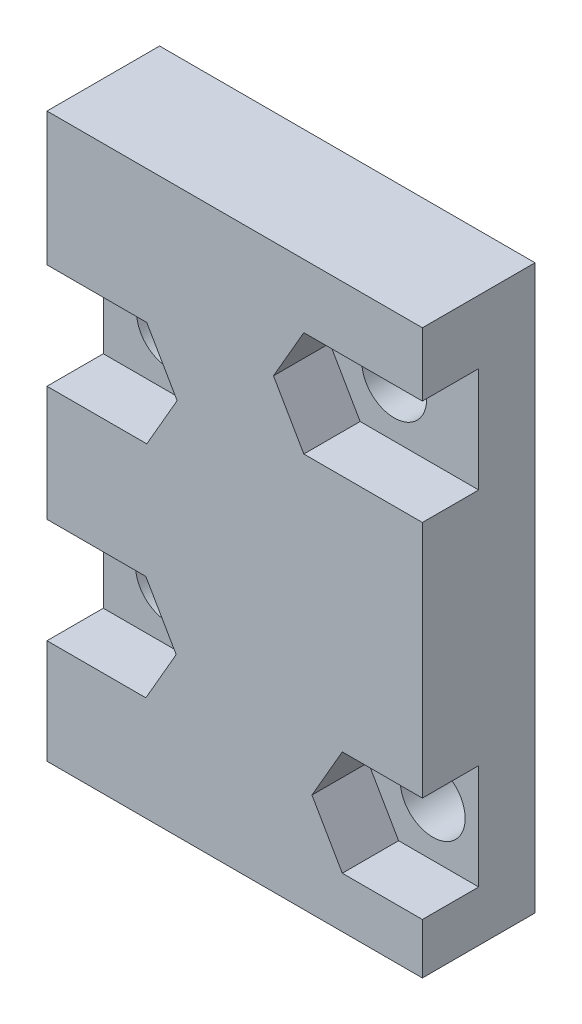
ISO-10303-21;
HEADER;
FILE_DESCRIPTION(('STEP AP214'),'2;1');
FILE_NAME('part.step','',(''),(''),'','','');
FILE_SCHEMA(('AUTOMOTIVE_DESIGN { 1 0 10303 214 1 1 1 1 }'));
ENDSEC;
DATA;
#1=APPLICATION_CONTEXT('core data for automotive mechanical design processes');
#2=APPLICATION_PROTOCOL_DEFINITION('international standard','automotive_design',2000,#1);
#3=PRODUCT_CONTEXT('',#1,'mechanical');
#4=PRODUCT('Part','Part','',(#3));
#5=PRODUCT_RELATED_PRODUCT_CATEGORY('part','',(#4));
#6=PRODUCT_DEFINITION_FORMATION('','',#4);
#7=PRODUCT_DEFINITION_CONTEXT('part definition',#1,'design');
#8=PRODUCT_DEFINITION('design','',#6,#7);
#9=PRODUCT_DEFINITION_SHAPE('','',#8);
#10=(LENGTH_UNIT() NAMED_UNIT(*) SI_UNIT(.MILLI.,.METRE.));
#11=(NAMED_UNIT(*) PLANE_ANGLE_UNIT() SI_UNIT($,.RADIAN.));
#12=(NAMED_UNIT(*) SI_UNIT($,.STERADIAN.) SOLID_ANGLE_UNIT());
#13=UNCERTAINTY_MEASURE_WITH_UNIT(LENGTH_MEASURE(1.E-05),#10,'distance_accuracy_value','');
#14=(GEOMETRIC_REPRESENTATION_CONTEXT(3) GLOBAL_UNCERTAINTY_ASSIGNED_CONTEXT((#13)) GLOBAL_UNIT_ASSIGNED_CONTEXT((#10,
#11,#12)) REPRESENTATION_CONTEXT('',''));
#15=CARTESIAN_POINT('',(0.,0.,0.));
#16=DIRECTION('',(0.,0.,1.));
#17=DIRECTION('',(1.,0.,0.));
#18=AXIS2_PLACEMENT_3D('',#15,#16,#17);
#19=CARTESIAN_POINT('',(17.55,5.5,0.));
#20=DIRECTION('',(0.,0.,1.));
#21=DIRECTION('',(1.,0.,0.));
#22=AXIS2_PLACEMENT_3D('',#19,#20,#21);
#23=CYLINDRICAL_SURFACE('',#22,1.72792936976744);
#24=CARTESIAN_POINT('',(17.55,5.5,0.));
#25=DIRECTION('',(0.,0.,1.));
#26=DIRECTION('',(1.,0.,0.));
#27=AXIS2_PLACEMENT_3D('',#24,#25,#26);
#28=CIRCLE('',#27,1.72792936976744);
#29=CARTESIAN_POINT('',(19.2779293697674,5.5,0.));
#30=VERTEX_POINT('',#29);
#31=EDGE_CURVE('E355',#30,#30,#28,.T.);
#32=ORIENTED_EDGE('',*,*,#31,.F.);
#33=EDGE_LOOP('',(#32));
#34=FACE_BOUND('',#33,.T.);
#35=CARTESIAN_POINT('',(17.55,5.5,3.));
#36=DIRECTION('',(0.,0.,1.));
#37=DIRECTION('',(1.,0.,0.));
#38=AXIS2_PLACEMENT_3D('',#35,#36,#37);
#39=CIRCLE('',#38,1.72792936976744);
#40=CARTESIAN_POINT('',(19.2779293697674,5.5,3.));
#41=VERTEX_POINT('',#40);
#42=EDGE_CURVE('E39',#41,#41,#39,.F.);
#43=ORIENTED_EDGE('',*,*,#42,.F.);
#44=EDGE_LOOP('',(#43));
#45=FACE_BOUND('',#44,.T.);
#46=ADVANCED_FACE('F35',(#34,#45),#23,.F.);
#47=CARTESIAN_POINT('',(3.45,8.36115949586285,0.));
#48=DIRECTION('',(0.,0.,1.));
#49=DIRECTION('',(1.,0.,0.));
#50=AXIS2_PLACEMENT_3D('',#47,#48,#49);
#51=CYLINDRICAL_SURFACE('',#50,1.72792936976744);
#52=CARTESIAN_POINT('',(3.45,8.36115949586285,0.));
#53=DIRECTION('',(0.,0.,1.));
#54=DIRECTION('',(1.,0.,0.));
#55=AXIS2_PLACEMENT_3D('',#52,#53,#54);
#56=CIRCLE('',#55,1.72792936976744);
#57=CARTESIAN_POINT('',(5.17792936976744,8.36115949586285,0.));
#58=VERTEX_POINT('',#57);
#59=EDGE_CURVE('E352',#58,#58,#56,.T.);
#60=ORIENTED_EDGE('',*,*,#59,.F.);
#61=EDGE_LOOP('',(#60));
#62=FACE_BOUND('',#61,.T.);
#63=CARTESIAN_POINT('',(3.45,8.36115949586285,3.));
#64=DIRECTION('',(0.,0.,1.));
#65=DIRECTION('',(1.,0.,0.));
#66=AXIS2_PLACEMENT_3D('',#63,#64,#65);
#67=CIRCLE('',#66,1.72792936976744);
#68=CARTESIAN_POINT('',(5.17792936976744,8.36115949586285,3.));
#69=VERTEX_POINT('',#68);
#70=EDGE_CURVE('E267',#69,#69,#67,.F.);
#71=ORIENTED_EDGE('',*,*,#70,.F.);
#72=EDGE_LOOP('',(#71));
#73=FACE_BOUND('',#72,.T.);
#74=ADVANCED_FACE('F403',(#62,#73),#51,.F.);
#75=CARTESIAN_POINT('',(3.5,20.1025733116612,0.));
#76=DIRECTION('',(0.,0.,1.));
#77=DIRECTION('',(1.,0.,0.));
#78=AXIS2_PLACEMENT_3D('',#75,#76,#77);
#79=CYLINDRICAL_SURFACE('',#78,1.72792936976743);
#80=CARTESIAN_POINT('',(3.5,20.1025733116612,0.));
#81=DIRECTION('',(0.,0.,1.));
#82=DIRECTION('',(1.,0.,0.));
#83=AXIS2_PLACEMENT_3D('',#80,#81,#82);
#84=CIRCLE('',#83,1.72792936976743);
#85=CARTESIAN_POINT('',(5.22792936976743,20.1025733116612,0.));
#86=VERTEX_POINT('',#85);
#87=EDGE_CURVE('E358',#86,#86,#84,.T.);
#88=ORIENTED_EDGE('',*,*,#87,.F.);
#89=EDGE_LOOP('',(#88));
#90=FACE_BOUND('',#89,.T.);
#91=CARTESIAN_POINT('',(3.5,20.1025733116612,3.));
#92=DIRECTION('',(0.,0.,1.));
#93=DIRECTION('',(1.,0.,0.));
#94=AXIS2_PLACEMENT_3D('',#91,#92,#93);
#95=CIRCLE('',#94,1.72792936976743);
#96=CARTESIAN_POINT('',(5.22792936976743,20.1025733116612,3.));
#97=VERTEX_POINT('',#96);
#98=EDGE_CURVE('E303',#97,#97,#95,.F.);
#99=ORIENTED_EDGE('',*,*,#98,.F.);
#100=EDGE_LOOP('',(#99));
#101=FACE_BOUND('',#100,.T.);
#102=ADVANCED_FACE('F405',(#90,#101),#79,.F.);
#103=CARTESIAN_POINT('',(15.5,23.8166940084953,0.));
#104=DIRECTION('',(0.,0.,1.));
#105=DIRECTION('',(1.,0.,0.));
#106=AXIS2_PLACEMENT_3D('',#103,#104,#105);
#107=CYLINDRICAL_SURFACE('',#106,1.72792936976744);
#108=CARTESIAN_POINT('',(15.5,23.8166940084953,0.));
#109=DIRECTION('',(0.,0.,1.));
#110=DIRECTION('',(1.,0.,0.));
#111=AXIS2_PLACEMENT_3D('',#108,#109,#110);
#112=CIRCLE('',#111,1.72792936976744);
#113=CARTESIAN_POINT('',(17.2279293697674,23.8166940084953,0.));
#114=VERTEX_POINT('',#113);
#115=EDGE_CURVE('E361',#114,#114,#112,.T.);
#116=ORIENTED_EDGE('',*,*,#115,.F.);
#117=EDGE_LOOP('',(#116));
#118=FACE_BOUND('',#117,.T.);
#119=CARTESIAN_POINT('',(15.5,23.8166940084953,3.));
#120=DIRECTION('',(0.,0.,1.));
#121=DIRECTION('',(1.,0.,0.));
#122=AXIS2_PLACEMENT_3D('',#119,#120,#121);
#123=CIRCLE('',#122,1.72792936976744);
#124=CARTESIAN_POINT('',(17.2279293697674,23.8166940084953,3.));
#125=VERTEX_POINT('',#124);
#126=EDGE_CURVE('E344',#125,#125,#123,.F.);
#127=ORIENTED_EDGE('',*,*,#126,.F.);
#128=EDGE_LOOP('',(#127));
#129=FACE_BOUND('',#128,.T.);
#130=ADVANCED_FACE('F412',(#118,#129),#107,.F.);
#131=CARTESIAN_POINT('',(0.,0.,6.));
#132=DIRECTION('',(1.,0.,0.));
#133=DIRECTION('',(0.,0.,-1.));
#134=AXIS2_PLACEMENT_3D('',#131,#132,#133);
#135=PLANE('',#134);
#136=DIRECTION('',(0.,-1.,0.));
#137=VECTOR('',#136,1.);
#138=CARTESIAN_POINT('',(0.,0.,6.));
#139=LINE('',#138,#137);
#140=CARTESIAN_POINT('',(0.,5.56115949586285,6.));
#141=VERTEX_POINT('',#140);
#142=CARTESIAN_POINT('',(0.,0.,6.));
#143=VERTEX_POINT('',#142);
#144=EDGE_CURVE('E370',#141,#143,#139,.T.);
#145=ORIENTED_EDGE('',*,*,#144,.F.);
#146=DIRECTION('',(0.,0.,1.));
#147=VECTOR('',#146,1.);
#148=CARTESIAN_POINT('',(0.,5.56115949586285,3.));
#149=LINE('',#148,#147);
#150=CARTESIAN_POINT('',(0.,5.56115949586285,3.));
#151=VERTEX_POINT('',#150);
#152=EDGE_CURVE('E268',#151,#141,#149,.T.);
#153=ORIENTED_EDGE('',*,*,#152,.F.);
#154=DIRECTION('',(0.,-1.,0.));
#155=VECTOR('',#154,1.);
#156=CARTESIAN_POINT('',(0.,5.56115949586285,3.));
#157=LINE('',#156,#155);
#158=CARTESIAN_POINT('',(0.,11.1611594958629,3.));
#159=VERTEX_POINT('',#158);
#160=EDGE_CURVE('E251',#159,#151,#157,.T.);
#161=ORIENTED_EDGE('',*,*,#160,.F.);
#162=DIRECTION('',(0.,0.,1.));
#163=VECTOR('',#162,1.);
#164=CARTESIAN_POINT('',(0.,11.1611594958629,3.));
#165=LINE('',#164,#163);
#166=CARTESIAN_POINT('',(0.,11.1611594958629,6.));
#167=VERTEX_POINT('',#166);
#168=EDGE_CURVE('E270',#159,#167,#165,.T.);
#169=ORIENTED_EDGE('',*,*,#168,.T.);
#170=CARTESIAN_POINT('',(0.,17.3025733116612,6.));
#171=VERTEX_POINT('',#170);
#172=EDGE_CURVE('E369',#171,#167,#139,.T.);
#173=ORIENTED_EDGE('',*,*,#172,.F.);
#174=DIRECTION('',(0.,0.,1.));
#175=VECTOR('',#174,1.);
#176=CARTESIAN_POINT('',(0.,17.3025733116612,3.));
#177=LINE('',#176,#175);
#178=CARTESIAN_POINT('',(0.,17.3025733116612,3.));
#179=VERTEX_POINT('',#178);
#180=EDGE_CURVE('E304',#179,#171,#177,.T.);
#181=ORIENTED_EDGE('',*,*,#180,.F.);
#182=DIRECTION('',(0.,-1.,0.));
#183=VECTOR('',#182,1.);
#184=CARTESIAN_POINT('',(0.,17.3025733116612,3.));
#185=LINE('',#184,#183);
#186=CARTESIAN_POINT('',(0.,22.9025733116612,3.));
#187=VERTEX_POINT('',#186);
#188=EDGE_CURVE('E286',#187,#179,#185,.T.);
#189=ORIENTED_EDGE('',*,*,#188,.F.);
#190=DIRECTION('',(0.,0.,1.));
#191=VECTOR('',#190,1.);
#192=CARTESIAN_POINT('',(0.,22.9025733116612,3.));
#193=LINE('',#192,#191);
#194=CARTESIAN_POINT('',(0.,22.9025733116612,6.));
#195=VERTEX_POINT('',#194);
#196=EDGE_CURVE('E306',#187,#195,#193,.T.);
#197=ORIENTED_EDGE('',*,*,#196,.T.);
#198=CARTESIAN_POINT('',(0.,30.,6.));
#199=VERTEX_POINT('',#198);
#200=EDGE_CURVE('E365',#199,#195,#139,.T.);
#201=ORIENTED_EDGE('',*,*,#200,.F.);
#202=DIRECTION('',(0.,0.,-1.));
#203=VECTOR('',#202,1.);
#204=CARTESIAN_POINT('',(0.,30.,6.));
#205=LINE('',#204,#203);
#206=CARTESIAN_POINT('',(0.,30.,0.));
#207=VERTEX_POINT('',#206);
#208=EDGE_CURVE('E379',#199,#207,#205,.T.);
#209=ORIENTED_EDGE('',*,*,#208,.T.);
#210=DIRECTION('',(0.,-1.,0.));
#211=VECTOR('',#210,1.);
#212=CARTESIAN_POINT('',(0.,0.,0.));
#213=LINE('',#212,#211);
#214=CARTESIAN_POINT('',(0.,0.,0.));
#215=VERTEX_POINT('',#214);
#216=EDGE_CURVE('E364',#207,#215,#213,.T.);
#217=ORIENTED_EDGE('',*,*,#216,.T.);
#218=DIRECTION('',(0.,0.,-1.));
#219=VECTOR('',#218,1.);
#220=CARTESIAN_POINT('',(0.,0.,6.));
#221=LINE('',#220,#219);
#222=EDGE_CURVE('E11',#143,#215,#221,.T.);
#223=ORIENTED_EDGE('',*,*,#222,.F.);
#224=EDGE_LOOP('',(#145,#153,#161,#169,#173,#181,#189,#197,#201,#209,#217,#223));
#225=FACE_BOUND('',#224,.T.);
#226=ADVANCED_FACE('F37',(#225),#135,.F.);
#227=CARTESIAN_POINT('',(0.,0.,6.));
#228=DIRECTION('',(0.,1.,0.));
#229=DIRECTION('',(0.,0.,1.));
#230=AXIS2_PLACEMENT_3D('',#227,#228,#229);
#231=PLANE('',#230);
#232=DIRECTION('',(1.,0.,0.));
#233=VECTOR('',#232,1.);
#234=CARTESIAN_POINT('',(0.,0.,0.));
#235=LINE('',#234,#233);
#236=CARTESIAN_POINT('',(20.,0.,0.));
#237=VERTEX_POINT('',#236);
#238=EDGE_CURVE('E382',#215,#237,#235,.T.);
#239=ORIENTED_EDGE('',*,*,#238,.T.);
#240=DIRECTION('',(0.,0.,-1.));
#241=VECTOR('',#240,1.);
#242=CARTESIAN_POINT('',(20.,0.,6.));
#243=LINE('',#242,#241);
#244=CARTESIAN_POINT('',(20.,0.,6.));
#245=VERTEX_POINT('',#244);
#246=EDGE_CURVE('E44',#245,#237,#243,.T.);
#247=ORIENTED_EDGE('',*,*,#246,.F.);
#248=DIRECTION('',(1.,0.,0.));
#249=VECTOR('',#248,1.);
#250=CARTESIAN_POINT('',(0.,0.,6.));
#251=LINE('',#250,#249);
#252=EDGE_CURVE('E368',#143,#245,#251,.T.);
#253=ORIENTED_EDGE('',*,*,#252,.F.);
#254=ORIENTED_EDGE('',*,*,#222,.T.);
#255=EDGE_LOOP('',(#239,#247,#253,#254));
#256=FACE_BOUND('',#255,.T.);
#257=ADVANCED_FACE('F440',(#256),#231,.F.);
#258=CARTESIAN_POINT('',(20.,0.,6.));
#259=DIRECTION('',(-1.,0.,0.));
#260=DIRECTION('',(0.,0.,1.));
#261=AXIS2_PLACEMENT_3D('',#258,#259,#260);
#262=PLANE('',#261);
#263=DIRECTION('',(0.,1.,0.));
#264=VECTOR('',#263,1.);
#265=CARTESIAN_POINT('',(20.,0.,6.));
#266=LINE('',#265,#264);
#267=CARTESIAN_POINT('',(20.,8.3,6.));
#268=VERTEX_POINT('',#267);
#269=CARTESIAN_POINT('',(20.,21.0166940084953,6.));
#270=VERTEX_POINT('',#269);
#271=EDGE_CURVE('E377',#268,#270,#266,.T.);
#272=ORIENTED_EDGE('',*,*,#271,.F.);
#273=DIRECTION('',(0.,0.,1.));
#274=VECTOR('',#273,1.);
#275=CARTESIAN_POINT('',(20.,8.3,3.));
#276=LINE('',#275,#274);
#277=CARTESIAN_POINT('',(20.,8.3,3.));
#278=VERTEX_POINT('',#277);
#279=EDGE_CURVE('E235',#278,#268,#276,.T.);
#280=ORIENTED_EDGE('',*,*,#279,.F.);
#281=DIRECTION('',(0.,1.,0.));
#282=VECTOR('',#281,1.);
#283=CARTESIAN_POINT('',(20.,2.7,3.));
#284=LINE('',#283,#282);
#285=CARTESIAN_POINT('',(20.,2.7,3.));
#286=VERTEX_POINT('',#285);
#287=EDGE_CURVE('E226',#286,#278,#284,.T.);
#288=ORIENTED_EDGE('',*,*,#287,.F.);
#289=DIRECTION('',(0.,0.,1.));
#290=VECTOR('',#289,1.);
#291=CARTESIAN_POINT('',(20.,2.7,3.));
#292=LINE('',#291,#290);
#293=CARTESIAN_POINT('',(20.,2.7,6.));
#294=VERTEX_POINT('',#293);
#295=EDGE_CURVE('E237',#286,#294,#292,.T.);
#296=ORIENTED_EDGE('',*,*,#295,.T.);
#297=EDGE_CURVE('E373',#245,#294,#266,.T.);
#298=ORIENTED_EDGE('',*,*,#297,.F.);
#299=ORIENTED_EDGE('',*,*,#246,.T.);
#300=DIRECTION('',(0.,1.,0.));
#301=VECTOR('',#300,1.);
#302=CARTESIAN_POINT('',(20.,0.,0.));
#303=LINE('',#302,#301);
#304=CARTESIAN_POINT('',(20.,30.,0.));
#305=VERTEX_POINT('',#304);
#306=EDGE_CURVE('E384',#237,#305,#303,.T.);
#307=ORIENTED_EDGE('',*,*,#306,.T.);
#308=DIRECTION('',(0.,0.,-1.));
#309=VECTOR('',#308,1.);
#310=CARTESIAN_POINT('',(20.,30.,6.));
#311=LINE('',#310,#309);
#312=CARTESIAN_POINT('',(20.,30.,6.));
#313=VERTEX_POINT('',#312);
#314=EDGE_CURVE('E390',#313,#305,#311,.T.);
#315=ORIENTED_EDGE('',*,*,#314,.F.);
#316=CARTESIAN_POINT('',(20.,26.6166940084953,6.));
#317=VERTEX_POINT('',#316);
#318=EDGE_CURVE('E372',#317,#313,#266,.T.);
#319=ORIENTED_EDGE('',*,*,#318,.F.);
#320=DIRECTION('',(0.,0.,1.));
#321=VECTOR('',#320,1.);
#322=CARTESIAN_POINT('',(20.,26.6166940084953,3.));
#323=LINE('',#322,#321);
#324=CARTESIAN_POINT('',(20.,26.6166940084953,3.));
#325=VERTEX_POINT('',#324);
#326=EDGE_CURVE('E329',#325,#317,#323,.T.);
#327=ORIENTED_EDGE('',*,*,#326,.F.);
#328=DIRECTION('',(0.,1.,0.));
#329=VECTOR('',#328,1.);
#330=CARTESIAN_POINT('',(20.,26.6166940084953,3.));
#331=LINE('',#330,#329);
#332=CARTESIAN_POINT('',(20.,21.0166940084953,3.));
#333=VERTEX_POINT('',#332);
#334=EDGE_CURVE('E313',#333,#325,#331,.T.);
#335=ORIENTED_EDGE('',*,*,#334,.F.);
#336=DIRECTION('',(0.,0.,1.));
#337=VECTOR('',#336,1.);
#338=CARTESIAN_POINT('',(20.,21.0166940084953,3.));
#339=LINE('',#338,#337);
#340=EDGE_CURVE('E341',#333,#270,#339,.T.);
#341=ORIENTED_EDGE('',*,*,#340,.T.);
#342=EDGE_LOOP('',(#272,#280,#288,#296,#298,#299,#307,#315,#319,#327,#335,#341));
#343=FACE_BOUND('',#342,.T.);
#344=ADVANCED_FACE('F437',(#343),#262,.F.);
#345=CARTESIAN_POINT('',(0.,30.,6.));
#346=DIRECTION('',(0.,-1.,0.));
#347=DIRECTION('',(0.,0.,-1.));
#348=AXIS2_PLACEMENT_3D('',#345,#346,#347);
#349=PLANE('',#348);
#350=DIRECTION('',(-1.,0.,0.));
#351=VECTOR('',#350,1.);
#352=CARTESIAN_POINT('',(0.,30.,0.));
#353=LINE('',#352,#351);
#354=EDGE_CURVE('E386',#305,#207,#353,.T.);
#355=ORIENTED_EDGE('',*,*,#354,.T.);
#356=ORIENTED_EDGE('',*,*,#208,.F.);
#357=DIRECTION('',(-1.,0.,0.));
#358=VECTOR('',#357,1.);
#359=CARTESIAN_POINT('',(0.,30.,6.));
#360=LINE('',#359,#358);
#361=EDGE_CURVE('E376',#313,#199,#360,.T.);
#362=ORIENTED_EDGE('',*,*,#361,.F.);
#363=ORIENTED_EDGE('',*,*,#314,.T.);
#364=EDGE_LOOP('',(#355,#356,#362,#363));
#365=FACE_BOUND('',#364,.T.);
#366=ADVANCED_FACE('F429',(#365),#349,.F.);
#367=CARTESIAN_POINT('',(0.,0.,6.));
#368=DIRECTION('',(0.,0.,-1.));
#369=DIRECTION('',(-1.,0.,0.));
#370=AXIS2_PLACEMENT_3D('',#367,#368,#369);
#371=PLANE('',#370);
#372=DIRECTION('',(-0.499999999999999,-0.866025403784439,0.));
#373=VECTOR('',#372,1.);
#374=CARTESIAN_POINT('',(15.7334192462691,8.3,6.));
#375=LINE('',#374,#373);
#376=CARTESIAN_POINT('',(15.7334192462691,8.3,6.));
#377=VERTEX_POINT('',#376);
#378=CARTESIAN_POINT('',(14.1168384925381,5.5,6.));
#379=VERTEX_POINT('',#378);
#380=EDGE_CURVE('E52',#377,#379,#375,.T.);
#381=ORIENTED_EDGE('',*,*,#380,.F.);
#382=DIRECTION('',(-1.,0.,0.));
#383=VECTOR('',#382,1.);
#384=CARTESIAN_POINT('',(20.,8.3,6.));
#385=LINE('',#384,#383);
#386=EDGE_CURVE('E219',#268,#377,#385,.T.);
#387=ORIENTED_EDGE('',*,*,#386,.F.);
#388=ORIENTED_EDGE('',*,*,#271,.T.);
#389=DIRECTION('',(1.,0.,0.));
#390=VECTOR('',#389,1.);
#391=CARTESIAN_POINT('',(13.6834192462691,21.0166940084953,6.));
#392=LINE('',#391,#390);
#393=CARTESIAN_POINT('',(13.6834192462691,21.0166940084953,6.));
#394=VERTEX_POINT('',#393);
#395=EDGE_CURVE('E317',#394,#270,#392,.T.);
#396=ORIENTED_EDGE('',*,*,#395,.F.);
#397=DIRECTION('',(0.5,-0.866025403784439,0.));
#398=VECTOR('',#397,1.);
#399=CARTESIAN_POINT('',(12.0668384925381,23.8166940084953,6.));
#400=LINE('',#399,#398);
#401=CARTESIAN_POINT('',(12.0668384925381,23.8166940084953,6.));
#402=VERTEX_POINT('',#401);
#403=EDGE_CURVE('E336',#402,#394,#400,.T.);
#404=ORIENTED_EDGE('',*,*,#403,.F.);
#405=DIRECTION('',(-0.5,-0.866025403784438,0.));
#406=VECTOR('',#405,1.);
#407=CARTESIAN_POINT('',(13.683419246269,26.6166940084953,6.));
#408=LINE('',#407,#406);
#409=CARTESIAN_POINT('',(13.683419246269,26.6166940084953,6.));
#410=VERTEX_POINT('',#409);
#411=EDGE_CURVE('E333',#410,#402,#408,.T.);
#412=ORIENTED_EDGE('',*,*,#411,.F.);
#413=DIRECTION('',(-1.,0.,0.));
#414=VECTOR('',#413,1.);
#415=CARTESIAN_POINT('',(20.,26.6166940084953,6.));
#416=LINE('',#415,#414);
#417=EDGE_CURVE('E330',#317,#410,#416,.T.);
#418=ORIENTED_EDGE('',*,*,#417,.F.);
#419=ORIENTED_EDGE('',*,*,#318,.T.);
#420=ORIENTED_EDGE('',*,*,#361,.T.);
#421=ORIENTED_EDGE('',*,*,#200,.T.);
#422=DIRECTION('',(-1.,0.,0.));
#423=VECTOR('',#422,1.);
#424=CARTESIAN_POINT('',(5.31658075373095,22.9025733116612,6.));
#425=LINE('',#424,#423);
#426=CARTESIAN_POINT('',(5.31658075373095,22.9025733116612,6.));
#427=VERTEX_POINT('',#426);
#428=EDGE_CURVE('E297',#427,#195,#425,.T.);
#429=ORIENTED_EDGE('',*,*,#428,.F.);
#430=DIRECTION('',(-0.5,0.866025403784439,0.));
#431=VECTOR('',#430,1.);
#432=CARTESIAN_POINT('',(6.93316150746191,20.1025733116612,6.));
#433=LINE('',#432,#431);
#434=CARTESIAN_POINT('',(6.93316150746191,20.1025733116612,6.));
#435=VERTEX_POINT('',#434);
#436=EDGE_CURVE('E294',#435,#427,#433,.T.);
#437=ORIENTED_EDGE('',*,*,#436,.F.);
#438=DIRECTION('',(0.5,0.866025403784438,0.));
#439=VECTOR('',#438,1.);
#440=CARTESIAN_POINT('',(5.31658075373095,17.3025733116612,6.));
#441=LINE('',#440,#439);
#442=CARTESIAN_POINT('',(5.31658075373095,17.3025733116612,6.));
#443=VERTEX_POINT('',#442);
#444=EDGE_CURVE('E292',#443,#435,#441,.T.);
#445=ORIENTED_EDGE('',*,*,#444,.F.);
#446=DIRECTION('',(1.,0.,0.));
#447=VECTOR('',#446,1.);
#448=CARTESIAN_POINT('',(0.,17.3025733116612,6.));
#449=LINE('',#448,#447);
#450=EDGE_CURVE('E280',#171,#443,#449,.T.);
#451=ORIENTED_EDGE('',*,*,#450,.F.);
#452=ORIENTED_EDGE('',*,*,#172,.T.);
#453=DIRECTION('',(-1.,0.,0.));
#454=VECTOR('',#453,1.);
#455=CARTESIAN_POINT('',(5.26658075373095,11.1611594958628,6.));
#456=LINE('',#455,#454);
#457=CARTESIAN_POINT('',(5.26658075373095,11.1611594958628,6.));
#458=VERTEX_POINT('',#457);
#459=EDGE_CURVE('E261',#458,#167,#456,.T.);
#460=ORIENTED_EDGE('',*,*,#459,.F.);
#461=DIRECTION('',(-0.5,0.866025403784439,0.));
#462=VECTOR('',#461,1.);
#463=CARTESIAN_POINT('',(6.8831615074619,8.36115949586285,6.));
#464=LINE('',#463,#462);
#465=CARTESIAN_POINT('',(6.8831615074619,8.36115949586285,6.));
#466=VERTEX_POINT('',#465);
#467=EDGE_CURVE('E258',#466,#458,#464,.T.);
#468=ORIENTED_EDGE('',*,*,#467,.F.);
#469=DIRECTION('',(0.499999999999999,0.866025403784439,0.));
#470=VECTOR('',#469,1.);
#471=CARTESIAN_POINT('',(5.26658075373095,5.56115949586285,6.));
#472=LINE('',#471,#470);
#473=CARTESIAN_POINT('',(5.26658075373095,5.56115949586285,6.));
#474=VERTEX_POINT('',#473);
#475=EDGE_CURVE('E60',#474,#466,#472,.T.);
#476=ORIENTED_EDGE('',*,*,#475,.F.);
#477=DIRECTION('',(1.,0.,0.));
#478=VECTOR('',#477,1.);
#479=CARTESIAN_POINT('',(0.,5.56115949586285,6.));
#480=LINE('',#479,#478);
#481=EDGE_CURVE('E245',#141,#474,#480,.T.);
#482=ORIENTED_EDGE('',*,*,#481,.F.);
#483=ORIENTED_EDGE('',*,*,#144,.T.);
#484=ORIENTED_EDGE('',*,*,#252,.T.);
#485=ORIENTED_EDGE('',*,*,#297,.T.);
#486=DIRECTION('',(1.,0.,0.));
#487=VECTOR('',#486,1.);
#488=CARTESIAN_POINT('',(15.7334192462691,2.7,6.));
#489=LINE('',#488,#487);
#490=CARTESIAN_POINT('',(15.7334192462691,2.7,6.));
#491=VERTEX_POINT('',#490);
#492=EDGE_CURVE('E222',#491,#294,#489,.T.);
#493=ORIENTED_EDGE('',*,*,#492,.F.);
#494=DIRECTION('',(0.5,-0.866025403784438,0.));
#495=VECTOR('',#494,1.);
#496=CARTESIAN_POINT('',(14.1168384925381,5.5,6.));
#497=LINE('',#496,#495);
#498=EDGE_CURVE('E230',#379,#491,#497,.T.);
#499=ORIENTED_EDGE('',*,*,#498,.F.);
#500=EDGE_LOOP('',(#381,#387,#388,#396,#404,#412,#418,#419,#420,#421,#429,#437,#445,#451,#452,
#460,#468,#476,#482,#483,#484,#485,#493,#499));
#501=FACE_BOUND('',#500,.T.);
#502=ADVANCED_FACE('F425',(#501),#371,.F.);
#503=CARTESIAN_POINT('',(0.,0.,0.));
#504=DIRECTION('',(0.,0.,-1.));
#505=DIRECTION('',(-1.,0.,0.));
#506=AXIS2_PLACEMENT_3D('',#503,#504,#505);
#507=PLANE('',#506);
#508=ORIENTED_EDGE('',*,*,#59,.T.);
#509=EDGE_LOOP('',(#508));
#510=FACE_BOUND('',#509,.T.);
#511=ORIENTED_EDGE('',*,*,#31,.T.);
#512=EDGE_LOOP('',(#511));
#513=FACE_BOUND('',#512,.T.);
#514=ORIENTED_EDGE('',*,*,#87,.T.);
#515=EDGE_LOOP('',(#514));
#516=FACE_BOUND('',#515,.T.);
#517=ORIENTED_EDGE('',*,*,#115,.T.);
#518=EDGE_LOOP('',(#517));
#519=FACE_BOUND('',#518,.T.);
#520=ORIENTED_EDGE('',*,*,#216,.F.);
#521=ORIENTED_EDGE('',*,*,#354,.F.);
#522=ORIENTED_EDGE('',*,*,#306,.F.);
#523=ORIENTED_EDGE('',*,*,#238,.F.);
#524=EDGE_LOOP('',(#520,#521,#522,#523));
#525=FACE_BOUND('',#524,.T.);
#526=ADVANCED_FACE('F428',(#510,#513,#516,#519,#525),#507,.T.);
#527=CARTESIAN_POINT('',(0.,0.,3.));
#528=DIRECTION('',(0.,0.,1.));
#529=DIRECTION('',(1.,0.,0.));
#530=AXIS2_PLACEMENT_3D('',#527,#528,#529);
#531=PLANE('',#530);
#532=ORIENTED_EDGE('',*,*,#334,.T.);
#533=DIRECTION('',(-1.,0.,0.));
#534=VECTOR('',#533,1.);
#535=CARTESIAN_POINT('',(20.,26.6166940084953,3.));
#536=LINE('',#535,#534);
#537=CARTESIAN_POINT('',(13.683419246269,26.6166940084953,3.));
#538=VERTEX_POINT('',#537);
#539=EDGE_CURVE('E316',#325,#538,#536,.T.);
#540=ORIENTED_EDGE('',*,*,#539,.T.);
#541=DIRECTION('',(-0.5,-0.866025403784438,0.));
#542=VECTOR('',#541,1.);
#543=CARTESIAN_POINT('',(13.683419246269,26.6166940084953,3.));
#544=LINE('',#543,#542);
#545=CARTESIAN_POINT('',(12.0668384925381,23.8166940084953,3.));
#546=VERTEX_POINT('',#545);
#547=EDGE_CURVE('E320',#538,#546,#544,.T.);
#548=ORIENTED_EDGE('',*,*,#547,.T.);
#549=DIRECTION('',(0.5,-0.866025403784439,0.));
#550=VECTOR('',#549,1.);
#551=CARTESIAN_POINT('',(12.0668384925381,23.8166940084953,3.));
#552=LINE('',#551,#550);
#553=CARTESIAN_POINT('',(13.6834192462691,21.0166940084953,3.));
#554=VERTEX_POINT('',#553);
#555=EDGE_CURVE('E323',#546,#554,#552,.T.);
#556=ORIENTED_EDGE('',*,*,#555,.T.);
#557=DIRECTION('',(1.,0.,0.));
#558=VECTOR('',#557,1.);
#559=CARTESIAN_POINT('',(13.6834192462691,21.0166940084953,3.));
#560=LINE('',#559,#558);
#561=EDGE_CURVE('E326',#554,#333,#560,.T.);
#562=ORIENTED_EDGE('',*,*,#561,.T.);
#563=EDGE_LOOP('',(#532,#540,#548,#556,#562));
#564=FACE_BOUND('',#563,.T.);
#565=ORIENTED_EDGE('',*,*,#126,.T.);
#566=EDGE_LOOP('',(#565));
#567=FACE_BOUND('',#566,.T.);
#568=ADVANCED_FACE('F433',(#564,#567),#531,.T.);
#569=CARTESIAN_POINT('',(13.6834192462691,21.0166940084953,3.));
#570=DIRECTION('',(0.,-1.,0.));
#571=DIRECTION('',(0.,0.,-1.));
#572=AXIS2_PLACEMENT_3D('',#569,#570,#571);
#573=PLANE('',#572);
#574=ORIENTED_EDGE('',*,*,#395,.T.);
#575=ORIENTED_EDGE('',*,*,#340,.F.);
#576=ORIENTED_EDGE('',*,*,#561,.F.);
#577=DIRECTION('',(0.,0.,1.));
#578=VECTOR('',#577,1.);
#579=CARTESIAN_POINT('',(13.6834192462691,21.0166940084953,3.));
#580=LINE('',#579,#578);
#581=EDGE_CURVE('E345',#554,#394,#580,.T.);
#582=ORIENTED_EDGE('',*,*,#581,.T.);
#583=EDGE_LOOP('',(#574,#575,#576,#582));
#584=FACE_BOUND('',#583,.T.);
#585=ADVANCED_FACE('F474',(#584),#573,.F.);
#586=CARTESIAN_POINT('',(12.0668384925381,23.8166940084953,3.));
#587=DIRECTION('',(-0.866025403784439,-0.5,0.));
#588=DIRECTION('',(0.5,-0.866025403784439,0.));
#589=AXIS2_PLACEMENT_3D('',#586,#587,#588);
#590=PLANE('',#589);
#591=ORIENTED_EDGE('',*,*,#403,.T.);
#592=ORIENTED_EDGE('',*,*,#581,.F.);
#593=ORIENTED_EDGE('',*,*,#555,.F.);
#594=DIRECTION('',(0.,0.,1.));
#595=VECTOR('',#594,1.);
#596=CARTESIAN_POINT('',(12.0668384925381,23.8166940084953,3.));
#597=LINE('',#596,#595);
#598=EDGE_CURVE('E347',#546,#402,#597,.T.);
#599=ORIENTED_EDGE('',*,*,#598,.T.);
#600=EDGE_LOOP('',(#591,#592,#593,#599));
#601=FACE_BOUND('',#600,.T.);
#602=ADVANCED_FACE('F482',(#601),#590,.F.);
#603=CARTESIAN_POINT('',(13.683419246269,26.6166940084953,3.));
#604=DIRECTION('',(-0.866025403784439,0.5,0.));
#605=DIRECTION('',(-0.5,-0.866025403784439,0.));
#606=AXIS2_PLACEMENT_3D('',#603,#604,#605);
#607=PLANE('',#606);
#608=ORIENTED_EDGE('',*,*,#411,.T.);
#609=ORIENTED_EDGE('',*,*,#598,.F.);
#610=ORIENTED_EDGE('',*,*,#547,.F.);
#611=DIRECTION('',(0.,0.,1.));
#612=VECTOR('',#611,1.);
#613=CARTESIAN_POINT('',(13.683419246269,26.6166940084953,3.));
#614=LINE('',#613,#612);
#615=EDGE_CURVE('E349',#538,#410,#614,.T.);
#616=ORIENTED_EDGE('',*,*,#615,.T.);
#617=EDGE_LOOP('',(#608,#609,#610,#616));
#618=FACE_BOUND('',#617,.T.);
#619=ADVANCED_FACE('F484',(#618),#607,.F.);
#620=CARTESIAN_POINT('',(20.,26.6166940084953,3.));
#621=DIRECTION('',(0.,1.,0.));
#622=DIRECTION('',(0.,0.,1.));
#623=AXIS2_PLACEMENT_3D('',#620,#621,#622);
#624=PLANE('',#623);
#625=ORIENTED_EDGE('',*,*,#417,.T.);
#626=ORIENTED_EDGE('',*,*,#615,.F.);
#627=ORIENTED_EDGE('',*,*,#539,.F.);
#628=ORIENTED_EDGE('',*,*,#326,.T.);
#629=EDGE_LOOP('',(#625,#626,#627,#628));
#630=FACE_BOUND('',#629,.T.);
#631=ADVANCED_FACE('F419',(#630),#624,.F.);
#632=CARTESIAN_POINT('',(0.,0.,3.));
#633=DIRECTION('',(0.,0.,1.));
#634=DIRECTION('',(1.,0.,0.));
#635=AXIS2_PLACEMENT_3D('',#632,#633,#634);
#636=PLANE('',#635);
#637=DIRECTION('',(0.5,0.866025403784438,0.));
#638=VECTOR('',#637,1.);
#639=CARTESIAN_POINT('',(5.31658075373095,17.3025733116612,3.));
#640=LINE('',#639,#638);
#641=CARTESIAN_POINT('',(5.31658075373095,17.3025733116612,3.));
#642=VERTEX_POINT('',#641);
#643=CARTESIAN_POINT('',(6.93316150746191,20.1025733116612,3.));
#644=VERTEX_POINT('',#643);
#645=EDGE_CURVE('E276',#642,#644,#640,.T.);
#646=ORIENTED_EDGE('',*,*,#645,.T.);
#647=DIRECTION('',(-0.5,0.866025403784439,0.));
#648=VECTOR('',#647,1.);
#649=CARTESIAN_POINT('',(6.93316150746191,20.1025733116612,3.));
#650=LINE('',#649,#648);
#651=CARTESIAN_POINT('',(5.31658075373095,22.9025733116612,3.));
#652=VERTEX_POINT('',#651);
#653=EDGE_CURVE('E279',#644,#652,#650,.T.);
#654=ORIENTED_EDGE('',*,*,#653,.T.);
#655=DIRECTION('',(-1.,0.,0.));
#656=VECTOR('',#655,1.);
#657=CARTESIAN_POINT('',(5.31658075373095,22.9025733116612,3.));
#658=LINE('',#657,#656);
#659=EDGE_CURVE('E283',#652,#187,#658,.T.);
#660=ORIENTED_EDGE('',*,*,#659,.T.);
#661=ORIENTED_EDGE('',*,*,#188,.T.);
#662=DIRECTION('',(1.,0.,0.));
#663=VECTOR('',#662,1.);
#664=CARTESIAN_POINT('',(0.,17.3025733116612,3.));
#665=LINE('',#664,#663);
#666=EDGE_CURVE('E288',#179,#642,#665,.T.);
#667=ORIENTED_EDGE('',*,*,#666,.T.);
#668=EDGE_LOOP('',(#646,#654,#660,#661,#667));
#669=FACE_BOUND('',#668,.T.);
#670=ORIENTED_EDGE('',*,*,#98,.T.);
#671=EDGE_LOOP('',(#670));
#672=FACE_BOUND('',#671,.T.);
#673=ADVANCED_FACE('F487',(#669,#672),#636,.T.);
#674=CARTESIAN_POINT('',(5.31658075373095,17.3025733116612,3.));
#675=DIRECTION('',(0.866025403784438,-0.5,0.));
#676=DIRECTION('',(0.5,0.866025403784438,0.));
#677=AXIS2_PLACEMENT_3D('',#674,#675,#676);
#678=PLANE('',#677);
#679=ORIENTED_EDGE('',*,*,#444,.T.);
#680=DIRECTION('',(0.,0.,1.));
#681=VECTOR('',#680,1.);
#682=CARTESIAN_POINT('',(6.93316150746191,20.1025733116612,3.));
#683=LINE('',#682,#681);
#684=EDGE_CURVE('E291',#644,#435,#683,.T.);
#685=ORIENTED_EDGE('',*,*,#684,.F.);
#686=ORIENTED_EDGE('',*,*,#645,.F.);
#687=DIRECTION('',(0.,0.,1.));
#688=VECTOR('',#687,1.);
#689=CARTESIAN_POINT('',(5.31658075373095,17.3025733116612,3.));
#690=LINE('',#689,#688);
#691=EDGE_CURVE('E301',#642,#443,#690,.T.);
#692=ORIENTED_EDGE('',*,*,#691,.T.);
#693=EDGE_LOOP('',(#679,#685,#686,#692));
#694=FACE_BOUND('',#693,.T.);
#695=ADVANCED_FACE('F492',(#694),#678,.F.);
#696=CARTESIAN_POINT('',(0.,17.3025733116612,3.));
#697=DIRECTION('',(0.,-1.,0.));
#698=DIRECTION('',(1.,0.,0.));
#699=AXIS2_PLACEMENT_3D('',#696,#697,#698);
#700=PLANE('',#699);
#701=ORIENTED_EDGE('',*,*,#450,.T.);
#702=ORIENTED_EDGE('',*,*,#691,.F.);
#703=ORIENTED_EDGE('',*,*,#666,.F.);
#704=ORIENTED_EDGE('',*,*,#180,.T.);
#705=EDGE_LOOP('',(#701,#702,#703,#704));
#706=FACE_BOUND('',#705,.T.);
#707=ADVANCED_FACE('F506',(#706),#700,.F.);
#708=CARTESIAN_POINT('',(5.31658075373095,22.9025733116612,3.));
#709=DIRECTION('',(0.,1.,0.));
#710=DIRECTION('',(-1.,0.,0.));
#711=AXIS2_PLACEMENT_3D('',#708,#709,#710);
#712=PLANE('',#711);
#713=ORIENTED_EDGE('',*,*,#428,.T.);
#714=ORIENTED_EDGE('',*,*,#196,.F.);
#715=ORIENTED_EDGE('',*,*,#659,.F.);
#716=DIRECTION('',(0.,0.,1.));
#717=VECTOR('',#716,1.);
#718=CARTESIAN_POINT('',(5.31658075373095,22.9025733116612,3.));
#719=LINE('',#718,#717);
#720=EDGE_CURVE('E309',#652,#427,#719,.T.);
#721=ORIENTED_EDGE('',*,*,#720,.T.);
#722=EDGE_LOOP('',(#713,#714,#715,#721));
#723=FACE_BOUND('',#722,.T.);
#724=ADVANCED_FACE('F511',(#723),#712,.F.);
#725=CARTESIAN_POINT('',(6.93316150746191,20.1025733116612,3.));
#726=DIRECTION('',(0.866025403784439,0.5,0.));
#727=DIRECTION('',(-0.5,0.866025403784439,0.));
#728=AXIS2_PLACEMENT_3D('',#725,#726,#727);
#729=PLANE('',#728);
#730=ORIENTED_EDGE('',*,*,#436,.T.);
#731=ORIENTED_EDGE('',*,*,#720,.F.);
#732=ORIENTED_EDGE('',*,*,#653,.F.);
#733=ORIENTED_EDGE('',*,*,#684,.T.);
#734=EDGE_LOOP('',(#730,#731,#732,#733));
#735=FACE_BOUND('',#734,.T.);
#736=ADVANCED_FACE('F508',(#735),#729,.F.);
#737=CARTESIAN_POINT('',(0.,0.,3.));
#738=DIRECTION('',(0.,0.,1.));
#739=DIRECTION('',(1.,0.,0.));
#740=AXIS2_PLACEMENT_3D('',#737,#738,#739);
#741=PLANE('',#740);
#742=DIRECTION('',(0.499999999999999,0.866025403784439,0.));
#743=VECTOR('',#742,1.);
#744=CARTESIAN_POINT('',(5.26658075373095,5.56115949586285,3.));
#745=LINE('',#744,#743);
#746=CARTESIAN_POINT('',(5.26658075373095,5.56115949586285,3.));
#747=VERTEX_POINT('',#746);
#748=CARTESIAN_POINT('',(6.8831615074619,8.36115949586285,3.));
#749=VERTEX_POINT('',#748);
#750=EDGE_CURVE('E241',#747,#749,#745,.T.);
#751=ORIENTED_EDGE('',*,*,#750,.T.);
#752=DIRECTION('',(-0.5,0.866025403784439,0.));
#753=VECTOR('',#752,1.);
#754=CARTESIAN_POINT('',(6.8831615074619,8.36115949586285,3.));
#755=LINE('',#754,#753);
#756=CARTESIAN_POINT('',(5.26658075373095,11.1611594958628,3.));
#757=VERTEX_POINT('',#756);
#758=EDGE_CURVE('E244',#749,#757,#755,.T.);
#759=ORIENTED_EDGE('',*,*,#758,.T.);
#760=DIRECTION('',(-1.,0.,0.));
#761=VECTOR('',#760,1.);
#762=CARTESIAN_POINT('',(5.26658075373095,11.1611594958628,3.));
#763=LINE('',#762,#761);
#764=EDGE_CURVE('E248',#757,#159,#763,.T.);
#765=ORIENTED_EDGE('',*,*,#764,.T.);
#766=ORIENTED_EDGE('',*,*,#160,.T.);
#767=DIRECTION('',(1.,0.,0.));
#768=VECTOR('',#767,1.);
#769=CARTESIAN_POINT('',(0.,5.56115949586285,3.));
#770=LINE('',#769,#768);
#771=EDGE_CURVE('E253',#151,#747,#770,.T.);
#772=ORIENTED_EDGE('',*,*,#771,.T.);
#773=EDGE_LOOP('',(#751,#759,#765,#766,#772));
#774=FACE_BOUND('',#773,.T.);
#775=ORIENTED_EDGE('',*,*,#70,.T.);
#776=EDGE_LOOP('',(#775));
#777=FACE_BOUND('',#776,.T.);
#778=ADVANCED_FACE('F401',(#774,#777),#741,.T.);
#779=CARTESIAN_POINT('',(5.26658075373095,5.56115949586285,3.));
#780=DIRECTION('',(0.866025403784439,-0.499999999999999,0.));
#781=DIRECTION('',(0.499999999999999,0.866025403784439,0.));
#782=AXIS2_PLACEMENT_3D('',#779,#780,#781);
#783=PLANE('',#782);
#784=ORIENTED_EDGE('',*,*,#475,.T.);
#785=DIRECTION('',(0.,0.,1.));
#786=VECTOR('',#785,1.);
#787=CARTESIAN_POINT('',(6.8831615074619,8.36115949586285,3.));
#788=LINE('',#787,#786);
#789=EDGE_CURVE('E256',#749,#466,#788,.T.);
#790=ORIENTED_EDGE('',*,*,#789,.F.);
#791=ORIENTED_EDGE('',*,*,#750,.F.);
#792=DIRECTION('',(0.,0.,1.));
#793=VECTOR('',#792,1.);
#794=CARTESIAN_POINT('',(5.26658075373095,5.56115949586285,3.));
#795=LINE('',#794,#793);
#796=EDGE_CURVE('E265',#747,#474,#795,.T.);
#797=ORIENTED_EDGE('',*,*,#796,.T.);
#798=EDGE_LOOP('',(#784,#790,#791,#797));
#799=FACE_BOUND('',#798,.T.);
#800=ADVANCED_FACE('F519',(#799),#783,.F.);
#801=CARTESIAN_POINT('',(0.,5.56115949586285,3.));
#802=DIRECTION('',(0.,-1.,0.));
#803=DIRECTION('',(1.,0.,0.));
#804=AXIS2_PLACEMENT_3D('',#801,#802,#803);
#805=PLANE('',#804);
#806=ORIENTED_EDGE('',*,*,#481,.T.);
#807=ORIENTED_EDGE('',*,*,#796,.F.);
#808=ORIENTED_EDGE('',*,*,#771,.F.);
#809=ORIENTED_EDGE('',*,*,#152,.T.);
#810=EDGE_LOOP('',(#806,#807,#808,#809));
#811=FACE_BOUND('',#810,.T.);
#812=ADVANCED_FACE('F522',(#811),#805,.F.);
#813=CARTESIAN_POINT('',(5.26658075373095,11.1611594958628,3.));
#814=DIRECTION('',(0.,1.,0.));
#815=DIRECTION('',(-1.,0.,0.));
#816=AXIS2_PLACEMENT_3D('',#813,#814,#815);
#817=PLANE('',#816);
#818=ORIENTED_EDGE('',*,*,#459,.T.);
#819=ORIENTED_EDGE('',*,*,#168,.F.);
#820=ORIENTED_EDGE('',*,*,#764,.F.);
#821=DIRECTION('',(0.,0.,1.));
#822=VECTOR('',#821,1.);
#823=CARTESIAN_POINT('',(5.26658075373095,11.1611594958628,3.));
#824=LINE('',#823,#822);
#825=EDGE_CURVE('E273',#757,#458,#824,.T.);
#826=ORIENTED_EDGE('',*,*,#825,.T.);
#827=EDGE_LOOP('',(#818,#819,#820,#826));
#828=FACE_BOUND('',#827,.T.);
#829=ADVANCED_FACE('F526',(#828),#817,.F.);
#830=CARTESIAN_POINT('',(6.8831615074619,8.36115949586285,3.));
#831=DIRECTION('',(0.866025403784438,0.5,0.));
#832=DIRECTION('',(-0.5,0.866025403784439,0.));
#833=AXIS2_PLACEMENT_3D('',#830,#831,#832);
#834=PLANE('',#833);
#835=ORIENTED_EDGE('',*,*,#467,.T.);
#836=ORIENTED_EDGE('',*,*,#825,.F.);
#837=ORIENTED_EDGE('',*,*,#758,.F.);
#838=ORIENTED_EDGE('',*,*,#789,.T.);
#839=EDGE_LOOP('',(#835,#836,#837,#838));
#840=FACE_BOUND('',#839,.T.);
#841=ADVANCED_FACE('F523',(#840),#834,.F.);
#842=CARTESIAN_POINT('',(0.,0.,3.));
#843=DIRECTION('',(0.,0.,1.));
#844=DIRECTION('',(1.,0.,0.));
#845=AXIS2_PLACEMENT_3D('',#842,#843,#844);
#846=PLANE('',#845);
#847=DIRECTION('',(-0.499999999999999,-0.866025403784439,0.));
#848=VECTOR('',#847,1.);
#849=CARTESIAN_POINT('',(15.7334192462691,8.3,3.));
#850=LINE('',#849,#848);
#851=CARTESIAN_POINT('',(15.7334192462691,8.3,3.));
#852=VERTEX_POINT('',#851);
#853=CARTESIAN_POINT('',(14.1168384925381,5.5,3.));
#854=VERTEX_POINT('',#853);
#855=EDGE_CURVE('E200',#852,#854,#850,.T.);
#856=ORIENTED_EDGE('',*,*,#855,.T.);
#857=DIRECTION('',(0.5,-0.866025403784438,0.));
#858=VECTOR('',#857,1.);
#859=CARTESIAN_POINT('',(14.1168384925381,5.5,3.));
#860=LINE('',#859,#858);
#861=CARTESIAN_POINT('',(15.7334192462691,2.7,3.));
#862=VERTEX_POINT('',#861);
#863=EDGE_CURVE('E209',#854,#862,#860,.T.);
#864=ORIENTED_EDGE('',*,*,#863,.T.);
#865=DIRECTION('',(1.,0.,0.));
#866=VECTOR('',#865,1.);
#867=CARTESIAN_POINT('',(15.7334192462691,2.7,3.));
#868=LINE('',#867,#866);
#869=EDGE_CURVE('E214',#862,#286,#868,.T.);
#870=ORIENTED_EDGE('',*,*,#869,.T.);
#871=ORIENTED_EDGE('',*,*,#287,.T.);
#872=DIRECTION('',(-1.,0.,0.));
#873=VECTOR('',#872,1.);
#874=CARTESIAN_POINT('',(20.,8.3,3.));
#875=LINE('',#874,#873);
#876=EDGE_CURVE('E206',#278,#852,#875,.T.);
#877=ORIENTED_EDGE('',*,*,#876,.T.);
#878=EDGE_LOOP('',(#856,#864,#870,#871,#877));
#879=FACE_BOUND('',#878,.T.);
#880=ORIENTED_EDGE('',*,*,#42,.T.);
#881=EDGE_LOOP('',(#880));
#882=FACE_BOUND('',#881,.T.);
#883=ADVANCED_FACE('F216',(#879,#882),#846,.T.);
#884=CARTESIAN_POINT('',(15.7334192462691,8.3,3.));
#885=DIRECTION('',(-0.866025403784439,0.499999999999999,0.));
#886=DIRECTION('',(-0.499999999999999,-0.866025403784439,0.));
#887=AXIS2_PLACEMENT_3D('',#884,#885,#886);
#888=PLANE('',#887);
#889=ORIENTED_EDGE('',*,*,#380,.T.);
#890=DIRECTION('',(0.,0.,1.));
#891=VECTOR('',#890,1.);
#892=CARTESIAN_POINT('',(14.1168384925381,5.5,3.));
#893=LINE('',#892,#891);
#894=EDGE_CURVE('E196',#854,#379,#893,.T.);
#895=ORIENTED_EDGE('',*,*,#894,.F.);
#896=ORIENTED_EDGE('',*,*,#855,.F.);
#897=DIRECTION('',(0.,0.,1.));
#898=VECTOR('',#897,1.);
#899=CARTESIAN_POINT('',(15.7334192462691,8.3,3.));
#900=LINE('',#899,#898);
#901=EDGE_CURVE('E233',#852,#377,#900,.T.);
#902=ORIENTED_EDGE('',*,*,#901,.T.);
#903=EDGE_LOOP('',(#889,#895,#896,#902));
#904=FACE_BOUND('',#903,.T.);
#905=ADVANCED_FACE('F198',(#904),#888,.F.);
#906=CARTESIAN_POINT('',(20.,8.3,3.));
#907=DIRECTION('',(0.,1.,0.));
#908=DIRECTION('',(0.,0.,1.));
#909=AXIS2_PLACEMENT_3D('',#906,#907,#908);
#910=PLANE('',#909);
#911=ORIENTED_EDGE('',*,*,#386,.T.);
#912=ORIENTED_EDGE('',*,*,#901,.F.);
#913=ORIENTED_EDGE('',*,*,#876,.F.);
#914=ORIENTED_EDGE('',*,*,#279,.T.);
#915=EDGE_LOOP('',(#911,#912,#913,#914));
#916=FACE_BOUND('',#915,.T.);
#917=ADVANCED_FACE('F539',(#916),#910,.F.);
#918=CARTESIAN_POINT('',(15.7334192462691,2.7,3.));
#919=DIRECTION('',(0.,-1.,0.));
#920=DIRECTION('',(1.,0.,0.));
#921=AXIS2_PLACEMENT_3D('',#918,#919,#920);
#922=PLANE('',#921);
#923=ORIENTED_EDGE('',*,*,#492,.T.);
#924=ORIENTED_EDGE('',*,*,#295,.F.);
#925=ORIENTED_EDGE('',*,*,#869,.F.);
#926=DIRECTION('',(0.,0.,1.));
#927=VECTOR('',#926,1.);
#928=CARTESIAN_POINT('',(15.7334192462691,2.7,3.));
#929=LINE('',#928,#927);
#930=EDGE_CURVE('E205',#862,#491,#929,.T.);
#931=ORIENTED_EDGE('',*,*,#930,.T.);
#932=EDGE_LOOP('',(#923,#924,#925,#931));
#933=FACE_BOUND('',#932,.T.);
#934=ADVANCED_FACE('F542',(#933),#922,.F.);
#935=CARTESIAN_POINT('',(14.1168384925381,5.5,3.));
#936=DIRECTION('',(-0.866025403784438,-0.500000000000001,0.));
#937=DIRECTION('',(0.500000000000001,-0.866025403784438,0.));
#938=AXIS2_PLACEMENT_3D('',#935,#936,#937);
#939=PLANE('',#938);
#940=ORIENTED_EDGE('',*,*,#498,.T.);
#941=ORIENTED_EDGE('',*,*,#930,.F.);
#942=ORIENTED_EDGE('',*,*,#863,.F.);
#943=ORIENTED_EDGE('',*,*,#894,.T.);
#944=EDGE_LOOP('',(#940,#941,#942,#943));
#945=FACE_BOUND('',#944,.T.);
#946=ADVANCED_FACE('F210',(#945),#939,.F.);
#947=CLOSED_SHELL('',(#46,#74,#102,#130,#226,#257,#344,#366,#502,#526,#568,#585,#602,#619,#631,
#673,#695,#707,#724,#736,#778,#800,#812,#829,#841,#883,#905,#917,#934,#946));
#948=MANIFOLD_SOLID_BREP('B2',#947);
#949=ADVANCED_BREP_SHAPE_REPRESENTATION('',(#18,#948),#14);
#950=SHAPE_DEFINITION_REPRESENTATION(#9,#949);
ENDSEC;
END-ISO-10303-21;
